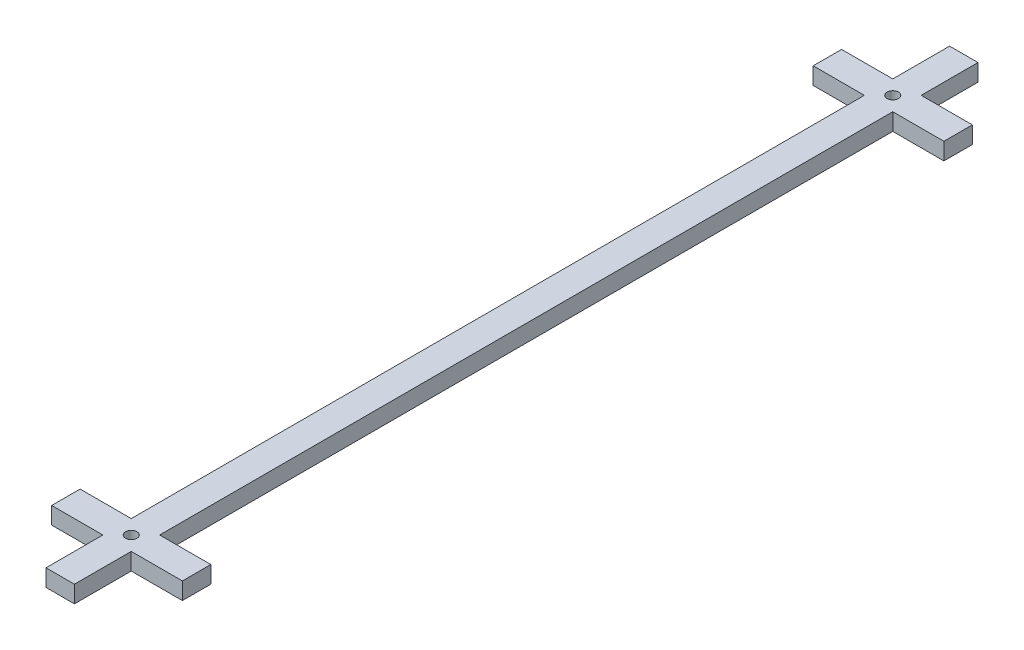
ISO-10303-21;
HEADER;
FILE_DESCRIPTION(('STEP AP214'),'2;1');
FILE_NAME('part.step','',(''),(''),'','','');
FILE_SCHEMA(('AUTOMOTIVE_DESIGN { 1 0 10303 214 1 1 1 1 }'));
ENDSEC;
DATA;
#1=APPLICATION_CONTEXT('core data for automotive mechanical design processes');
#2=APPLICATION_PROTOCOL_DEFINITION('international standard','automotive_design',2000,#1);
#3=PRODUCT_CONTEXT('',#1,'mechanical');
#4=PRODUCT('Part','Part','',(#3));
#5=PRODUCT_RELATED_PRODUCT_CATEGORY('part','',(#4));
#6=PRODUCT_DEFINITION_FORMATION('','',#4);
#7=PRODUCT_DEFINITION_CONTEXT('part definition',#1,'design');
#8=PRODUCT_DEFINITION('design','',#6,#7);
#9=PRODUCT_DEFINITION_SHAPE('','',#8);
#10=(LENGTH_UNIT() NAMED_UNIT(*) SI_UNIT(.MILLI.,.METRE.));
#11=(NAMED_UNIT(*) PLANE_ANGLE_UNIT() SI_UNIT($,.RADIAN.));
#12=(NAMED_UNIT(*) SI_UNIT($,.STERADIAN.) SOLID_ANGLE_UNIT());
#13=UNCERTAINTY_MEASURE_WITH_UNIT(LENGTH_MEASURE(1.E-05),#10,'distance_accuracy_value','');
#14=(GEOMETRIC_REPRESENTATION_CONTEXT(3) GLOBAL_UNCERTAINTY_ASSIGNED_CONTEXT((#13)) GLOBAL_UNIT_ASSIGNED_CONTEXT((#10,
#11,#12)) REPRESENTATION_CONTEXT('',''));
#15=CARTESIAN_POINT('',(0.,0.,0.));
#16=DIRECTION('',(0.,0.,1.));
#17=DIRECTION('',(1.,0.,0.));
#18=AXIS2_PLACEMENT_3D('',#15,#16,#17);
#19=CARTESIAN_POINT('',(0.,3.,0.));
#20=DIRECTION('',(1.,0.,0.));
#21=DIRECTION('',(0.,0.,-1.));
#22=AXIS2_PLACEMENT_3D('',#19,#20,#21);
#23=PLANE('',#22);
#24=DIRECTION('',(0.,1.,0.));
#25=VECTOR('',#24,1.);
#26=CARTESIAN_POINT('',(0.,3.,-144.));
#27=LINE('',#26,#25);
#28=CARTESIAN_POINT('',(0.,0.,-144.));
#29=VERTEX_POINT('',#28);
#30=CARTESIAN_POINT('',(0.,3.,-144.));
#31=VERTEX_POINT('',#30);
#32=EDGE_CURVE('E187',#29,#31,#27,.T.);
#33=ORIENTED_EDGE('',*,*,#32,.F.);
#34=DIRECTION('',(0.,0.,1.));
#35=VECTOR('',#34,1.);
#36=CARTESIAN_POINT('',(0.,0.,0.));
#37=LINE('',#36,#35);
#38=CARTESIAN_POINT('',(0.,0.,-15.));
#39=VERTEX_POINT('',#38);
#40=EDGE_CURVE('E316',#29,#39,#37,.T.);
#41=ORIENTED_EDGE('',*,*,#40,.T.);
#42=DIRECTION('',(0.,-1.,0.));
#43=VECTOR('',#42,1.);
#44=CARTESIAN_POINT('',(0.,3.,-15.));
#45=LINE('',#44,#43);
#46=CARTESIAN_POINT('',(0.,3.,-15.));
#47=VERTEX_POINT('',#46);
#48=EDGE_CURVE('E282',#47,#39,#45,.T.);
#49=ORIENTED_EDGE('',*,*,#48,.F.);
#50=DIRECTION('',(0.,0.,1.));
#51=VECTOR('',#50,1.);
#52=CARTESIAN_POINT('',(0.,3.,0.));
#53=LINE('',#52,#51);
#54=EDGE_CURVE('E299',#31,#47,#53,.T.);
#55=ORIENTED_EDGE('',*,*,#54,.F.);
#56=EDGE_LOOP('',(#33,#41,#49,#55));
#57=FACE_BOUND('',#56,.T.);
#58=ADVANCED_FACE('F39',(#57),#23,.F.);
#59=DIRECTION('',(0.,-1.,0.));
#60=VECTOR('',#59,1.);
#61=CARTESIAN_POINT('',(0.,3.,-149.));
#62=LINE('',#61,#60);
#63=CARTESIAN_POINT('',(0.,3.,-149.));
#64=VERTEX_POINT('',#63);
#65=CARTESIAN_POINT('',(0.,0.,-149.));
#66=VERTEX_POINT('',#65);
#67=EDGE_CURVE('E214',#64,#66,#62,.T.);
#68=ORIENTED_EDGE('',*,*,#67,.F.);
#69=CARTESIAN_POINT('',(0.,3.,-159.));
#70=VERTEX_POINT('',#69);
#71=EDGE_CURVE('E295',#70,#64,#53,.T.);
#72=ORIENTED_EDGE('',*,*,#71,.F.);
#73=DIRECTION('',(0.,-1.,0.));
#74=VECTOR('',#73,1.);
#75=CARTESIAN_POINT('',(0.,3.,-159.));
#76=LINE('',#75,#74);
#77=CARTESIAN_POINT('',(0.,0.,-159.));
#78=VERTEX_POINT('',#77);
#79=EDGE_CURVE('E311',#70,#78,#76,.T.);
#80=ORIENTED_EDGE('',*,*,#79,.T.);
#81=EDGE_CURVE('E312',#78,#66,#37,.T.);
#82=ORIENTED_EDGE('',*,*,#81,.T.);
#83=EDGE_LOOP('',(#68,#72,#80,#82));
#84=FACE_BOUND('',#83,.T.);
#85=ADVANCED_FACE('F422',(#84),#23,.F.);
#86=CARTESIAN_POINT('',(5.,3.,0.));
#87=DIRECTION('',(-1.,0.,0.));
#88=DIRECTION('',(0.,0.,1.));
#89=AXIS2_PLACEMENT_3D('',#86,#87,#88);
#90=PLANE('',#89);
#91=DIRECTION('',(0.,-1.,0.));
#92=VECTOR('',#91,1.);
#93=CARTESIAN_POINT('',(5.,3.,-144.));
#94=LINE('',#93,#92);
#95=CARTESIAN_POINT('',(5.,3.,-144.));
#96=VERTEX_POINT('',#95);
#97=CARTESIAN_POINT('',(5.,0.,-144.));
#98=VERTEX_POINT('',#97);
#99=EDGE_CURVE('E63',#96,#98,#94,.T.);
#100=ORIENTED_EDGE('',*,*,#99,.F.);
#101=DIRECTION('',(0.,0.,-1.));
#102=VECTOR('',#101,1.);
#103=CARTESIAN_POINT('',(5.,3.,0.));
#104=LINE('',#103,#102);
#105=CARTESIAN_POINT('',(5.,3.,-15.));
#106=VERTEX_POINT('',#105);
#107=EDGE_CURVE('E308',#106,#96,#104,.T.);
#108=ORIENTED_EDGE('',*,*,#107,.F.);
#109=DIRECTION('',(0.,1.,0.));
#110=VECTOR('',#109,1.);
#111=CARTESIAN_POINT('',(5.,3.,-15.));
#112=LINE('',#111,#110);
#113=CARTESIAN_POINT('',(5.,0.,-15.));
#114=VERTEX_POINT('',#113);
#115=EDGE_CURVE('E278',#114,#106,#112,.T.);
#116=ORIENTED_EDGE('',*,*,#115,.F.);
#117=DIRECTION('',(0.,0.,-1.));
#118=VECTOR('',#117,1.);
#119=CARTESIAN_POINT('',(5.,0.,0.));
#120=LINE('',#119,#118);
#121=EDGE_CURVE('E324',#114,#98,#120,.T.);
#122=ORIENTED_EDGE('',*,*,#121,.T.);
#123=EDGE_LOOP('',(#100,#108,#116,#122));
#124=FACE_BOUND('',#123,.T.);
#125=ADVANCED_FACE('F427',(#124),#90,.F.);
#126=DIRECTION('',(0.,1.,0.));
#127=VECTOR('',#126,1.);
#128=CARTESIAN_POINT('',(5.,3.,-149.));
#129=LINE('',#128,#127);
#130=CARTESIAN_POINT('',(5.,0.,-149.));
#131=VERTEX_POINT('',#130);
#132=CARTESIAN_POINT('',(5.,3.,-149.));
#133=VERTEX_POINT('',#132);
#134=EDGE_CURVE('E209',#131,#133,#129,.T.);
#135=ORIENTED_EDGE('',*,*,#134,.F.);
#136=CARTESIAN_POINT('',(5.,0.,-159.));
#137=VERTEX_POINT('',#136);
#138=EDGE_CURVE('E319',#131,#137,#120,.T.);
#139=ORIENTED_EDGE('',*,*,#138,.T.);
#140=DIRECTION('',(0.,-1.,0.));
#141=VECTOR('',#140,1.);
#142=CARTESIAN_POINT('',(5.,3.,-159.));
#143=LINE('',#142,#141);
#144=CARTESIAN_POINT('',(5.,3.,-159.));
#145=VERTEX_POINT('',#144);
#146=EDGE_CURVE('E330',#145,#137,#143,.T.);
#147=ORIENTED_EDGE('',*,*,#146,.F.);
#148=EDGE_CURVE('E55',#133,#145,#104,.T.);
#149=ORIENTED_EDGE('',*,*,#148,.F.);
#150=EDGE_LOOP('',(#135,#139,#147,#149));
#151=FACE_BOUND('',#150,.T.);
#152=ADVANCED_FACE('F406',(#151),#90,.F.);
#153=DIRECTION('',(0.,1.,0.));
#154=VECTOR('',#153,1.);
#155=CARTESIAN_POINT('',(0.,3.,-10.));
#156=LINE('',#155,#154);
#157=CARTESIAN_POINT('',(0.,0.,-10.));
#158=VERTEX_POINT('',#157);
#159=CARTESIAN_POINT('',(0.,3.,-10.));
#160=VERTEX_POINT('',#159);
#161=EDGE_CURVE('E290',#158,#160,#156,.T.);
#162=ORIENTED_EDGE('',*,*,#161,.F.);
#163=CARTESIAN_POINT('',(0.,0.,0.));
#164=VERTEX_POINT('',#163);
#165=EDGE_CURVE('E294',#158,#164,#37,.T.);
#166=ORIENTED_EDGE('',*,*,#165,.T.);
#167=DIRECTION('',(0.,-1.,0.));
#168=VECTOR('',#167,1.);
#169=CARTESIAN_POINT('',(0.,3.,0.));
#170=LINE('',#169,#168);
#171=CARTESIAN_POINT('',(0.,3.,0.));
#172=VERTEX_POINT('',#171);
#173=EDGE_CURVE('E11',#172,#164,#170,.T.);
#174=ORIENTED_EDGE('',*,*,#173,.F.);
#175=EDGE_CURVE('E300',#160,#172,#53,.T.);
#176=ORIENTED_EDGE('',*,*,#175,.F.);
#177=EDGE_LOOP('',(#162,#166,#174,#176));
#178=FACE_BOUND('',#177,.T.);
#179=ADVANCED_FACE('F41',(#178),#23,.F.);
#180=DIRECTION('',(0.,-1.,0.));
#181=VECTOR('',#180,1.);
#182=CARTESIAN_POINT('',(5.,3.,-10.));
#183=LINE('',#182,#181);
#184=CARTESIAN_POINT('',(5.,3.,-10.));
#185=VERTEX_POINT('',#184);
#186=CARTESIAN_POINT('',(5.,0.,-10.));
#187=VERTEX_POINT('',#186);
#188=EDGE_CURVE('E286',#185,#187,#183,.T.);
#189=ORIENTED_EDGE('',*,*,#188,.F.);
#190=CARTESIAN_POINT('',(5.,3.,0.));
#191=VERTEX_POINT('',#190);
#192=EDGE_CURVE('E303',#191,#185,#104,.T.);
#193=ORIENTED_EDGE('',*,*,#192,.F.);
#194=DIRECTION('',(0.,-1.,0.));
#195=VECTOR('',#194,1.);
#196=CARTESIAN_POINT('',(5.,3.,0.));
#197=LINE('',#196,#195);
#198=CARTESIAN_POINT('',(5.,0.,0.));
#199=VERTEX_POINT('',#198);
#200=EDGE_CURVE('E48',#191,#199,#197,.T.);
#201=ORIENTED_EDGE('',*,*,#200,.T.);
#202=EDGE_CURVE('E320',#199,#187,#120,.T.);
#203=ORIENTED_EDGE('',*,*,#202,.T.);
#204=EDGE_LOOP('',(#189,#193,#201,#203));
#205=FACE_BOUND('',#204,.T.);
#206=ADVANCED_FACE('F339',(#205),#90,.F.);
#207=CARTESIAN_POINT('',(0.,3.,0.));
#208=DIRECTION('',(0.,0.,-1.));
#209=DIRECTION('',(-1.,0.,0.));
#210=AXIS2_PLACEMENT_3D('',#207,#208,#209);
#211=PLANE('',#210);
#212=DIRECTION('',(1.,0.,0.));
#213=VECTOR('',#212,1.);
#214=CARTESIAN_POINT('',(0.,0.,0.));
#215=LINE('',#214,#213);
#216=EDGE_CURVE('E315',#164,#199,#215,.T.);
#217=ORIENTED_EDGE('',*,*,#216,.T.);
#218=ORIENTED_EDGE('',*,*,#200,.F.);
#219=DIRECTION('',(1.,0.,0.));
#220=VECTOR('',#219,1.);
#221=CARTESIAN_POINT('',(0.,3.,0.));
#222=LINE('',#221,#220);
#223=EDGE_CURVE('E298',#172,#191,#222,.T.);
#224=ORIENTED_EDGE('',*,*,#223,.F.);
#225=ORIENTED_EDGE('',*,*,#173,.T.);
#226=EDGE_LOOP('',(#217,#218,#224,#225));
#227=FACE_BOUND('',#226,.T.);
#228=ADVANCED_FACE('F435',(#227),#211,.F.);
#229=CARTESIAN_POINT('',(0.,3.,-159.));
#230=DIRECTION('',(0.,0.,1.));
#231=DIRECTION('',(1.,0.,0.));
#232=AXIS2_PLACEMENT_3D('',#229,#230,#231);
#233=PLANE('',#232);
#234=DIRECTION('',(-1.,0.,0.));
#235=VECTOR('',#234,1.);
#236=CARTESIAN_POINT('',(0.,0.,-159.));
#237=LINE('',#236,#235);
#238=EDGE_CURVE('E323',#137,#78,#237,.T.);
#239=ORIENTED_EDGE('',*,*,#238,.T.);
#240=ORIENTED_EDGE('',*,*,#79,.F.);
#241=DIRECTION('',(-1.,0.,0.));
#242=VECTOR('',#241,1.);
#243=CARTESIAN_POINT('',(0.,3.,-159.));
#244=LINE('',#243,#242);
#245=EDGE_CURVE('E307',#145,#70,#244,.T.);
#246=ORIENTED_EDGE('',*,*,#245,.F.);
#247=ORIENTED_EDGE('',*,*,#146,.T.);
#248=EDGE_LOOP('',(#239,#240,#246,#247));
#249=FACE_BOUND('',#248,.T.);
#250=ADVANCED_FACE('F491',(#249),#233,.F.);
#251=CARTESIAN_POINT('',(0.,3.,0.));
#252=DIRECTION('',(0.,-1.,0.));
#253=DIRECTION('',(0.,0.,-1.));
#254=AXIS2_PLACEMENT_3D('',#251,#252,#253);
#255=PLANE('',#254);
#256=CARTESIAN_POINT('',(2.5,3.,-12.5));
#257=DIRECTION('',(0.,1.,0.));
#258=DIRECTION('',(0.,0.,1.));
#259=AXIS2_PLACEMENT_3D('',#256,#257,#258);
#260=CIRCLE('',#259,1.);
#261=CARTESIAN_POINT('',(2.5,3.,-11.5));
#262=VERTEX_POINT('',#261);
#263=EDGE_CURVE('E383',#262,#262,#260,.T.);
#264=ORIENTED_EDGE('',*,*,#263,.F.);
#265=EDGE_LOOP('',(#264));
#266=FACE_BOUND('',#265,.T.);
#267=CARTESIAN_POINT('',(2.5,3.,-146.5));
#268=DIRECTION('',(0.,1.,0.));
#269=DIRECTION('',(0.,0.,1.));
#270=AXIS2_PLACEMENT_3D('',#267,#268,#269);
#271=CIRCLE('',#270,1.);
#272=CARTESIAN_POINT('',(2.5,3.,-145.5));
#273=VERTEX_POINT('',#272);
#274=EDGE_CURVE('E460',#273,#273,#271,.T.);
#275=ORIENTED_EDGE('',*,*,#274,.F.);
#276=EDGE_LOOP('',(#275));
#277=FACE_BOUND('',#276,.T.);
#278=ORIENTED_EDGE('',*,*,#71,.T.);
#279=DIRECTION('',(-1.,0.,0.));
#280=VECTOR('',#279,1.);
#281=CARTESIAN_POINT('',(-9.,3.,-149.));
#282=LINE('',#281,#280);
#283=CARTESIAN_POINT('',(-9.,3.,-149.));
#284=VERTEX_POINT('',#283);
#285=EDGE_CURVE('E198',#64,#284,#282,.T.);
#286=ORIENTED_EDGE('',*,*,#285,.T.);
#287=DIRECTION('',(0.,0.,1.));
#288=VECTOR('',#287,1.);
#289=CARTESIAN_POINT('',(-9.,3.,-149.));
#290=LINE('',#289,#288);
#291=CARTESIAN_POINT('',(-9.,3.,-144.));
#292=VERTEX_POINT('',#291);
#293=EDGE_CURVE('E194',#284,#292,#290,.T.);
#294=ORIENTED_EDGE('',*,*,#293,.T.);
#295=DIRECTION('',(1.,0.,0.));
#296=VECTOR('',#295,1.);
#297=CARTESIAN_POINT('',(-9.,3.,-144.));
#298=LINE('',#297,#296);
#299=EDGE_CURVE('E179',#292,#31,#298,.T.);
#300=ORIENTED_EDGE('',*,*,#299,.T.);
#301=ORIENTED_EDGE('',*,*,#54,.T.);
#302=DIRECTION('',(-1.,0.,0.));
#303=VECTOR('',#302,1.);
#304=CARTESIAN_POINT('',(-9.,3.,-15.));
#305=LINE('',#304,#303);
#306=CARTESIAN_POINT('',(-9.,3.,-15.));
#307=VERTEX_POINT('',#306);
#308=EDGE_CURVE('E242',#47,#307,#305,.T.);
#309=ORIENTED_EDGE('',*,*,#308,.T.);
#310=DIRECTION('',(0.,0.,1.));
#311=VECTOR('',#310,1.);
#312=CARTESIAN_POINT('',(-9.,3.,-15.));
#313=LINE('',#312,#311);
#314=CARTESIAN_POINT('',(-9.,3.,-10.));
#315=VERTEX_POINT('',#314);
#316=EDGE_CURVE('E229',#307,#315,#313,.T.);
#317=ORIENTED_EDGE('',*,*,#316,.T.);
#318=DIRECTION('',(1.,0.,0.));
#319=VECTOR('',#318,1.);
#320=CARTESIAN_POINT('',(-9.,3.,-10.));
#321=LINE('',#320,#319);
#322=EDGE_CURVE('E235',#315,#160,#321,.T.);
#323=ORIENTED_EDGE('',*,*,#322,.T.);
#324=ORIENTED_EDGE('',*,*,#175,.T.);
#325=ORIENTED_EDGE('',*,*,#223,.T.);
#326=ORIENTED_EDGE('',*,*,#192,.T.);
#327=CARTESIAN_POINT('',(14.,3.,-10.));
#328=VERTEX_POINT('',#327);
#329=EDGE_CURVE('E233',#185,#328,#321,.T.);
#330=ORIENTED_EDGE('',*,*,#329,.T.);
#331=DIRECTION('',(0.,0.,-1.));
#332=VECTOR('',#331,1.);
#333=CARTESIAN_POINT('',(14.,3.,-15.));
#334=LINE('',#333,#332);
#335=CARTESIAN_POINT('',(14.,3.,-15.));
#336=VERTEX_POINT('',#335);
#337=EDGE_CURVE('E239',#328,#336,#334,.T.);
#338=ORIENTED_EDGE('',*,*,#337,.T.);
#339=EDGE_CURVE('E243',#336,#106,#305,.T.);
#340=ORIENTED_EDGE('',*,*,#339,.T.);
#341=ORIENTED_EDGE('',*,*,#107,.T.);
#342=CARTESIAN_POINT('',(14.,3.,-144.));
#343=VERTEX_POINT('',#342);
#344=EDGE_CURVE('E191',#96,#343,#298,.T.);
#345=ORIENTED_EDGE('',*,*,#344,.T.);
#346=DIRECTION('',(0.,0.,-1.));
#347=VECTOR('',#346,1.);
#348=CARTESIAN_POINT('',(14.,3.,-149.));
#349=LINE('',#348,#347);
#350=CARTESIAN_POINT('',(14.,3.,-149.));
#351=VERTEX_POINT('',#350);
#352=EDGE_CURVE('E190',#343,#351,#349,.T.);
#353=ORIENTED_EDGE('',*,*,#352,.T.);
#354=EDGE_CURVE('E375',#351,#133,#282,.T.);
#355=ORIENTED_EDGE('',*,*,#354,.T.);
#356=ORIENTED_EDGE('',*,*,#148,.T.);
#357=ORIENTED_EDGE('',*,*,#245,.T.);
#358=EDGE_LOOP('',(#278,#286,#294,#300,#301,#309,#317,#323,#324,#325,#326,#330,#338,#340,#341,
#345,#353,#355,#356,#357));
#359=FACE_BOUND('',#358,.T.);
#360=ADVANCED_FACE('F196',(#266,#277,#359),#255,.F.);
#361=CARTESIAN_POINT('',(0.,0.,0.));
#362=DIRECTION('',(0.,-1.,0.));
#363=DIRECTION('',(0.,0.,-1.));
#364=AXIS2_PLACEMENT_3D('',#361,#362,#363);
#365=PLANE('',#364);
#366=CARTESIAN_POINT('',(2.5,0.,-12.5));
#367=DIRECTION('',(0.,1.,0.));
#368=DIRECTION('',(0.,0.,1.));
#369=AXIS2_PLACEMENT_3D('',#366,#367,#368);
#370=CIRCLE('',#369,1.);
#371=CARTESIAN_POINT('',(2.5,0.,-11.5));
#372=VERTEX_POINT('',#371);
#373=EDGE_CURVE('E456',#372,#372,#370,.T.);
#374=ORIENTED_EDGE('',*,*,#373,.T.);
#375=EDGE_LOOP('',(#374));
#376=FACE_BOUND('',#375,.T.);
#377=CARTESIAN_POINT('',(2.5,0.,-146.5));
#378=DIRECTION('',(0.,1.,0.));
#379=DIRECTION('',(0.,0.,1.));
#380=AXIS2_PLACEMENT_3D('',#377,#378,#379);
#381=CIRCLE('',#380,1.);
#382=CARTESIAN_POINT('',(2.5,0.,-145.5));
#383=VERTEX_POINT('',#382);
#384=EDGE_CURVE('E464',#383,#383,#381,.T.);
#385=ORIENTED_EDGE('',*,*,#384,.T.);
#386=EDGE_LOOP('',(#385));
#387=FACE_BOUND('',#386,.T.);
#388=ORIENTED_EDGE('',*,*,#138,.F.);
#389=DIRECTION('',(-1.,0.,0.));
#390=VECTOR('',#389,1.);
#391=CARTESIAN_POINT('',(-9.,0.,-149.));
#392=LINE('',#391,#390);
#393=CARTESIAN_POINT('',(14.,0.,-149.));
#394=VERTEX_POINT('',#393);
#395=EDGE_CURVE('E203',#394,#131,#392,.T.);
#396=ORIENTED_EDGE('',*,*,#395,.F.);
#397=DIRECTION('',(0.,0.,-1.));
#398=VECTOR('',#397,1.);
#399=CARTESIAN_POINT('',(14.,0.,-149.));
#400=LINE('',#399,#398);
#401=CARTESIAN_POINT('',(14.,0.,-144.));
#402=VERTEX_POINT('',#401);
#403=EDGE_CURVE('E387',#402,#394,#400,.T.);
#404=ORIENTED_EDGE('',*,*,#403,.F.);
#405=DIRECTION('',(1.,0.,0.));
#406=VECTOR('',#405,1.);
#407=CARTESIAN_POINT('',(-9.,0.,-144.));
#408=LINE('',#407,#406);
#409=EDGE_CURVE('E382',#98,#402,#408,.T.);
#410=ORIENTED_EDGE('',*,*,#409,.F.);
#411=ORIENTED_EDGE('',*,*,#121,.F.);
#412=DIRECTION('',(-1.,0.,0.));
#413=VECTOR('',#412,1.);
#414=CARTESIAN_POINT('',(-9.,0.,-15.));
#415=LINE('',#414,#413);
#416=CARTESIAN_POINT('',(14.,0.,-15.));
#417=VERTEX_POINT('',#416);
#418=EDGE_CURVE('E234',#417,#114,#415,.T.);
#419=ORIENTED_EDGE('',*,*,#418,.F.);
#420=DIRECTION('',(0.,0.,-1.));
#421=VECTOR('',#420,1.);
#422=CARTESIAN_POINT('',(14.,0.,-15.));
#423=LINE('',#422,#421);
#424=CARTESIAN_POINT('',(14.,0.,-10.));
#425=VERTEX_POINT('',#424);
#426=EDGE_CURVE('E256',#425,#417,#423,.T.);
#427=ORIENTED_EDGE('',*,*,#426,.F.);
#428=DIRECTION('',(1.,0.,0.));
#429=VECTOR('',#428,1.);
#430=CARTESIAN_POINT('',(-9.,0.,-10.));
#431=LINE('',#430,#429);
#432=EDGE_CURVE('E251',#187,#425,#431,.T.);
#433=ORIENTED_EDGE('',*,*,#432,.F.);
#434=ORIENTED_EDGE('',*,*,#202,.F.);
#435=ORIENTED_EDGE('',*,*,#216,.F.);
#436=ORIENTED_EDGE('',*,*,#165,.F.);
#437=CARTESIAN_POINT('',(-9.,0.,-10.));
#438=VERTEX_POINT('',#437);
#439=EDGE_CURVE('E252',#438,#158,#431,.T.);
#440=ORIENTED_EDGE('',*,*,#439,.F.);
#441=DIRECTION('',(0.,0.,1.));
#442=VECTOR('',#441,1.);
#443=CARTESIAN_POINT('',(-9.,0.,-15.));
#444=LINE('',#443,#442);
#445=CARTESIAN_POINT('',(-9.,0.,-15.));
#446=VERTEX_POINT('',#445);
#447=EDGE_CURVE('E228',#446,#438,#444,.T.);
#448=ORIENTED_EDGE('',*,*,#447,.F.);
#449=EDGE_CURVE('E259',#39,#446,#415,.T.);
#450=ORIENTED_EDGE('',*,*,#449,.F.);
#451=ORIENTED_EDGE('',*,*,#40,.F.);
#452=CARTESIAN_POINT('',(-9.,0.,-144.));
#453=VERTEX_POINT('',#452);
#454=EDGE_CURVE('E384',#453,#29,#408,.T.);
#455=ORIENTED_EDGE('',*,*,#454,.F.);
#456=DIRECTION('',(0.,0.,1.));
#457=VECTOR('',#456,1.);
#458=CARTESIAN_POINT('',(-9.,0.,-149.));
#459=LINE('',#458,#457);
#460=CARTESIAN_POINT('',(-9.,0.,-149.));
#461=VERTEX_POINT('',#460);
#462=EDGE_CURVE('E207',#461,#453,#459,.T.);
#463=ORIENTED_EDGE('',*,*,#462,.F.);
#464=EDGE_CURVE('E390',#66,#461,#392,.T.);
#465=ORIENTED_EDGE('',*,*,#464,.F.);
#466=ORIENTED_EDGE('',*,*,#81,.F.);
#467=ORIENTED_EDGE('',*,*,#238,.F.);
#468=EDGE_LOOP('',(#388,#396,#404,#410,#411,#419,#427,#433,#434,#435,#436,#440,#448,#450,#451,
#455,#463,#465,#466,#467));
#469=FACE_BOUND('',#468,.T.);
#470=ADVANCED_FACE('F345',(#376,#387,#469),#365,.T.);
#471=CARTESIAN_POINT('',(14.,3.,-15.));
#472=DIRECTION('',(-1.,0.,0.));
#473=DIRECTION('',(0.,0.,1.));
#474=AXIS2_PLACEMENT_3D('',#471,#472,#473);
#475=PLANE('',#474);
#476=ORIENTED_EDGE('',*,*,#426,.T.);
#477=DIRECTION('',(0.,-1.,0.));
#478=VECTOR('',#477,1.);
#479=CARTESIAN_POINT('',(14.,3.,-15.));
#480=LINE('',#479,#478);
#481=EDGE_CURVE('E266',#336,#417,#480,.T.);
#482=ORIENTED_EDGE('',*,*,#481,.F.);
#483=ORIENTED_EDGE('',*,*,#337,.F.);
#484=DIRECTION('',(0.,-1.,0.));
#485=VECTOR('',#484,1.);
#486=CARTESIAN_POINT('',(14.,3.,-10.));
#487=LINE('',#486,#485);
#488=EDGE_CURVE('E270',#328,#425,#487,.T.);
#489=ORIENTED_EDGE('',*,*,#488,.T.);
#490=EDGE_LOOP('',(#476,#482,#483,#489));
#491=FACE_BOUND('',#490,.T.);
#492=ADVANCED_FACE('F502',(#491),#475,.F.);
#493=CARTESIAN_POINT('',(-9.,3.,-15.));
#494=DIRECTION('',(0.,0.,1.));
#495=DIRECTION('',(1.,0.,0.));
#496=AXIS2_PLACEMENT_3D('',#493,#494,#495);
#497=PLANE('',#496);
#498=ORIENTED_EDGE('',*,*,#418,.T.);
#499=ORIENTED_EDGE('',*,*,#115,.T.);
#500=ORIENTED_EDGE('',*,*,#339,.F.);
#501=ORIENTED_EDGE('',*,*,#481,.T.);
#502=EDGE_LOOP('',(#498,#499,#500,#501));
#503=FACE_BOUND('',#502,.T.);
#504=ADVANCED_FACE('F510',(#503),#497,.F.);
#505=CARTESIAN_POINT('',(-9.,3.,-10.));
#506=DIRECTION('',(0.,0.,-1.));
#507=DIRECTION('',(-1.,0.,0.));
#508=AXIS2_PLACEMENT_3D('',#505,#506,#507);
#509=PLANE('',#508);
#510=ORIENTED_EDGE('',*,*,#329,.F.);
#511=ORIENTED_EDGE('',*,*,#188,.T.);
#512=ORIENTED_EDGE('',*,*,#432,.T.);
#513=ORIENTED_EDGE('',*,*,#488,.F.);
#514=EDGE_LOOP('',(#510,#511,#512,#513));
#515=FACE_BOUND('',#514,.T.);
#516=ADVANCED_FACE('F507',(#515),#509,.F.);
#517=ORIENTED_EDGE('',*,*,#439,.T.);
#518=ORIENTED_EDGE('',*,*,#161,.T.);
#519=ORIENTED_EDGE('',*,*,#322,.F.);
#520=DIRECTION('',(0.,-1.,0.));
#521=VECTOR('',#520,1.);
#522=CARTESIAN_POINT('',(-9.,3.,-10.));
#523=LINE('',#522,#521);
#524=EDGE_CURVE('E274',#315,#438,#523,.T.);
#525=ORIENTED_EDGE('',*,*,#524,.T.);
#526=EDGE_LOOP('',(#517,#518,#519,#525));
#527=FACE_BOUND('',#526,.T.);
#528=ADVANCED_FACE('F440',(#527),#509,.F.);
#529=ORIENTED_EDGE('',*,*,#308,.F.);
#530=ORIENTED_EDGE('',*,*,#48,.T.);
#531=ORIENTED_EDGE('',*,*,#449,.T.);
#532=DIRECTION('',(0.,-1.,0.));
#533=VECTOR('',#532,1.);
#534=CARTESIAN_POINT('',(-9.,3.,-15.));
#535=LINE('',#534,#533);
#536=EDGE_CURVE('E247',#307,#446,#535,.T.);
#537=ORIENTED_EDGE('',*,*,#536,.F.);
#538=EDGE_LOOP('',(#529,#530,#531,#537));
#539=FACE_BOUND('',#538,.T.);
#540=ADVANCED_FACE('F417',(#539),#497,.F.);
#541=CARTESIAN_POINT('',(-9.,3.,-15.));
#542=DIRECTION('',(1.,0.,0.));
#543=DIRECTION('',(0.,0.,-1.));
#544=AXIS2_PLACEMENT_3D('',#541,#542,#543);
#545=PLANE('',#544);
#546=ORIENTED_EDGE('',*,*,#447,.T.);
#547=ORIENTED_EDGE('',*,*,#524,.F.);
#548=ORIENTED_EDGE('',*,*,#316,.F.);
#549=ORIENTED_EDGE('',*,*,#536,.T.);
#550=EDGE_LOOP('',(#546,#547,#548,#549));
#551=FACE_BOUND('',#550,.T.);
#552=ADVANCED_FACE('F409',(#551),#545,.F.);
#553=CARTESIAN_POINT('',(14.,3.,-149.));
#554=DIRECTION('',(-1.,0.,0.));
#555=DIRECTION('',(0.,0.,1.));
#556=AXIS2_PLACEMENT_3D('',#553,#554,#555);
#557=PLANE('',#556);
#558=ORIENTED_EDGE('',*,*,#403,.T.);
#559=DIRECTION('',(0.,-1.,0.));
#560=VECTOR('',#559,1.);
#561=CARTESIAN_POINT('',(14.,3.,-149.));
#562=LINE('',#561,#560);
#563=EDGE_CURVE('E217',#351,#394,#562,.T.);
#564=ORIENTED_EDGE('',*,*,#563,.F.);
#565=ORIENTED_EDGE('',*,*,#352,.F.);
#566=DIRECTION('',(0.,-1.,0.));
#567=VECTOR('',#566,1.);
#568=CARTESIAN_POINT('',(14.,3.,-144.));
#569=LINE('',#568,#567);
#570=EDGE_CURVE('E210',#343,#402,#569,.T.);
#571=ORIENTED_EDGE('',*,*,#570,.T.);
#572=EDGE_LOOP('',(#558,#564,#565,#571));
#573=FACE_BOUND('',#572,.T.);
#574=ADVANCED_FACE('F407',(#573),#557,.F.);
#575=CARTESIAN_POINT('',(-9.,3.,-149.));
#576=DIRECTION('',(0.,0.,1.));
#577=DIRECTION('',(1.,0.,0.));
#578=AXIS2_PLACEMENT_3D('',#575,#576,#577);
#579=PLANE('',#578);
#580=ORIENTED_EDGE('',*,*,#395,.T.);
#581=ORIENTED_EDGE('',*,*,#134,.T.);
#582=ORIENTED_EDGE('',*,*,#354,.F.);
#583=ORIENTED_EDGE('',*,*,#563,.T.);
#584=EDGE_LOOP('',(#580,#581,#582,#583));
#585=FACE_BOUND('',#584,.T.);
#586=ADVANCED_FACE('F401',(#585),#579,.F.);
#587=CARTESIAN_POINT('',(-9.,3.,-144.));
#588=DIRECTION('',(0.,0.,-1.));
#589=DIRECTION('',(-1.,0.,0.));
#590=AXIS2_PLACEMENT_3D('',#587,#588,#589);
#591=PLANE('',#590);
#592=ORIENTED_EDGE('',*,*,#344,.F.);
#593=ORIENTED_EDGE('',*,*,#99,.T.);
#594=ORIENTED_EDGE('',*,*,#409,.T.);
#595=ORIENTED_EDGE('',*,*,#570,.F.);
#596=EDGE_LOOP('',(#592,#593,#594,#595));
#597=FACE_BOUND('',#596,.T.);
#598=ADVANCED_FACE('F367',(#597),#591,.F.);
#599=ORIENTED_EDGE('',*,*,#454,.T.);
#600=ORIENTED_EDGE('',*,*,#32,.T.);
#601=ORIENTED_EDGE('',*,*,#299,.F.);
#602=DIRECTION('',(0.,-1.,0.));
#603=VECTOR('',#602,1.);
#604=CARTESIAN_POINT('',(-9.,3.,-144.));
#605=LINE('',#604,#603);
#606=EDGE_CURVE('E184',#292,#453,#605,.T.);
#607=ORIENTED_EDGE('',*,*,#606,.T.);
#608=EDGE_LOOP('',(#599,#600,#601,#607));
#609=FACE_BOUND('',#608,.T.);
#610=ADVANCED_FACE('F182',(#609),#591,.F.);
#611=ORIENTED_EDGE('',*,*,#285,.F.);
#612=ORIENTED_EDGE('',*,*,#67,.T.);
#613=ORIENTED_EDGE('',*,*,#464,.T.);
#614=DIRECTION('',(0.,-1.,0.));
#615=VECTOR('',#614,1.);
#616=CARTESIAN_POINT('',(-9.,3.,-149.));
#617=LINE('',#616,#615);
#618=EDGE_CURVE('E379',#284,#461,#617,.T.);
#619=ORIENTED_EDGE('',*,*,#618,.F.);
#620=EDGE_LOOP('',(#611,#612,#613,#619));
#621=FACE_BOUND('',#620,.T.);
#622=ADVANCED_FACE('F416',(#621),#579,.F.);
#623=CARTESIAN_POINT('',(-9.,3.,-149.));
#624=DIRECTION('',(1.,0.,0.));
#625=DIRECTION('',(0.,0.,-1.));
#626=AXIS2_PLACEMENT_3D('',#623,#624,#625);
#627=PLANE('',#626);
#628=ORIENTED_EDGE('',*,*,#462,.T.);
#629=ORIENTED_EDGE('',*,*,#606,.F.);
#630=ORIENTED_EDGE('',*,*,#293,.F.);
#631=ORIENTED_EDGE('',*,*,#618,.T.);
#632=EDGE_LOOP('',(#628,#629,#630,#631));
#633=FACE_BOUND('',#632,.T.);
#634=ADVANCED_FACE('F205',(#633),#627,.F.);
#635=CARTESIAN_POINT('',(2.5,3.,-146.5));
#636=DIRECTION('',(0.,-1.,0.));
#637=DIRECTION('',(0.,0.,-1.));
#638=AXIS2_PLACEMENT_3D('',#635,#636,#637);
#639=CYLINDRICAL_SURFACE('',#638,1.);
#640=ORIENTED_EDGE('',*,*,#274,.T.);
#641=EDGE_LOOP('',(#640));
#642=FACE_BOUND('',#641,.T.);
#643=ORIENTED_EDGE('',*,*,#384,.F.);
#644=EDGE_LOOP('',(#643));
#645=FACE_BOUND('',#644,.T.);
#646=ADVANCED_FACE('F470',(#642,#645),#639,.F.);
#647=CARTESIAN_POINT('',(2.5,3.,-12.5));
#648=DIRECTION('',(0.,-1.,0.));
#649=DIRECTION('',(0.,0.,-1.));
#650=AXIS2_PLACEMENT_3D('',#647,#648,#649);
#651=CYLINDRICAL_SURFACE('',#650,1.);
#652=ORIENTED_EDGE('',*,*,#263,.T.);
#653=EDGE_LOOP('',(#652));
#654=FACE_BOUND('',#653,.T.);
#655=ORIENTED_EDGE('',*,*,#373,.F.);
#656=EDGE_LOOP('',(#655));
#657=FACE_BOUND('',#656,.T.);
#658=ADVANCED_FACE('F472',(#654,#657),#651,.F.);
#659=CLOSED_SHELL('',(#58,#85,#125,#152,#179,#206,#228,#250,#360,#470,#492,#504,#516,#528,#540,
#552,#574,#586,#598,#610,#622,#634,#646,#658));
#660=MANIFOLD_SOLID_BREP('B2',#659);
#661=ADVANCED_BREP_SHAPE_REPRESENTATION('',(#18,#660),#14);
#662=SHAPE_DEFINITION_REPRESENTATION(#9,#661);
ENDSEC;
END-ISO-10303-21;
